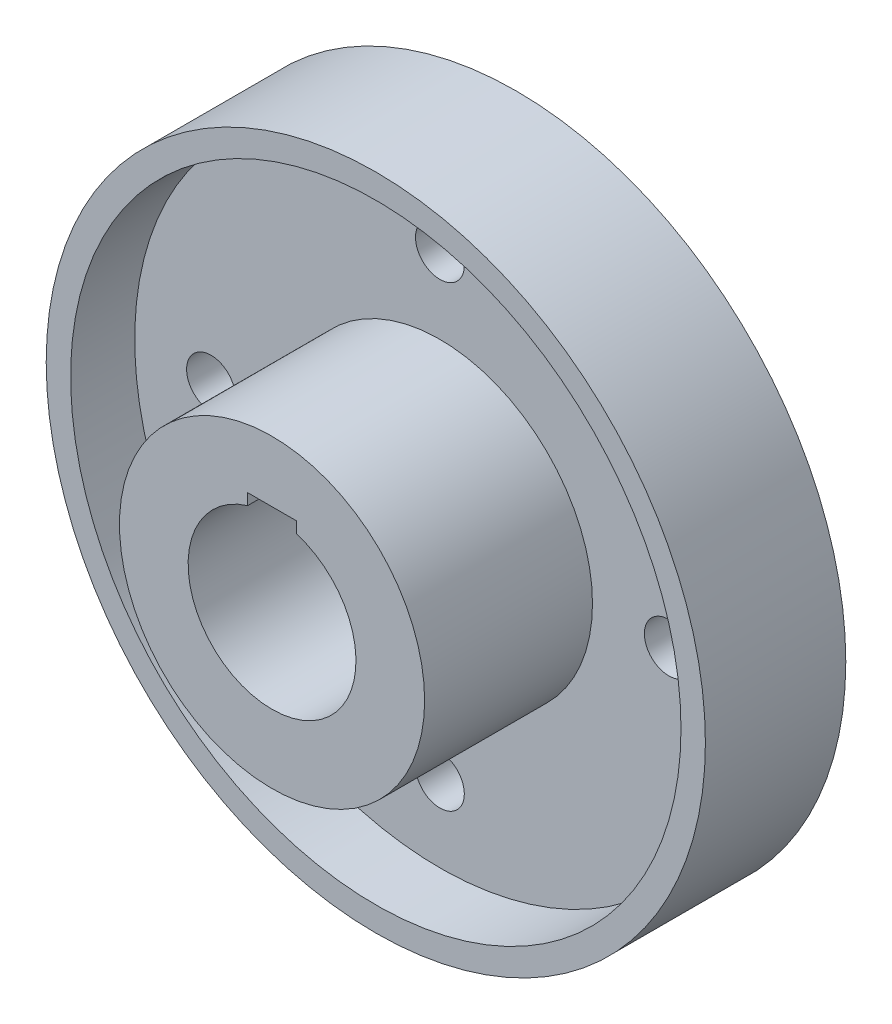
ISO-10303-21;
HEADER;
FILE_DESCRIPTION(('STEP AP214'),'2;1');
FILE_NAME('part.step','',(''),(''),'','','');
FILE_SCHEMA(('AUTOMOTIVE_DESIGN { 1 0 10303 214 1 1 1 1 }'));
ENDSEC;
DATA;
#1=APPLICATION_CONTEXT('core data for automotive mechanical design processes');
#2=APPLICATION_PROTOCOL_DEFINITION('international standard','automotive_design',2000,#1);
#3=PRODUCT_CONTEXT('',#1,'mechanical');
#4=PRODUCT('Part','Part','',(#3));
#5=PRODUCT_RELATED_PRODUCT_CATEGORY('part','',(#4));
#6=PRODUCT_DEFINITION_FORMATION('','',#4);
#7=PRODUCT_DEFINITION_CONTEXT('part definition',#1,'design');
#8=PRODUCT_DEFINITION('design','',#6,#7);
#9=PRODUCT_DEFINITION_SHAPE('','',#8);
#10=(LENGTH_UNIT() NAMED_UNIT(*) SI_UNIT(.MILLI.,.METRE.));
#11=(NAMED_UNIT(*) PLANE_ANGLE_UNIT() SI_UNIT($,.RADIAN.));
#12=(NAMED_UNIT(*) SI_UNIT($,.STERADIAN.) SOLID_ANGLE_UNIT());
#13=UNCERTAINTY_MEASURE_WITH_UNIT(LENGTH_MEASURE(1.E-05),#10,'distance_accuracy_value','');
#14=(GEOMETRIC_REPRESENTATION_CONTEXT(3) GLOBAL_UNCERTAINTY_ASSIGNED_CONTEXT((#13)) GLOBAL_UNIT_ASSIGNED_CONTEXT((#10,
#11,#12)) REPRESENTATION_CONTEXT('',''));
#15=CARTESIAN_POINT('',(0.,0.,0.));
#16=DIRECTION('',(0.,0.,1.));
#17=DIRECTION('',(1.,0.,0.));
#18=AXIS2_PLACEMENT_3D('',#15,#16,#17);
#19=CARTESIAN_POINT('',(0.,0.,25.));
#20=DIRECTION('',(0.,0.,-1.));
#21=DIRECTION('',(-1.,0.,0.));
#22=AXIS2_PLACEMENT_3D('',#19,#20,#21);
#23=CYLINDRICAL_SURFACE('',#22,108.);
#24=CARTESIAN_POINT('',(0.,0.,0.));
#25=DIRECTION('',(0.,0.,1.));
#26=DIRECTION('',(1.,0.,0.));
#27=AXIS2_PLACEMENT_3D('',#24,#25,#26);
#28=CIRCLE('',#27,108.);
#29=CARTESIAN_POINT('',(108.,0.,0.));
#30=VERTEX_POINT('',#29);
#31=EDGE_CURVE('E149',#30,#30,#28,.T.);
#32=ORIENTED_EDGE('',*,*,#31,.T.);
#33=EDGE_LOOP('',(#32));
#34=FACE_BOUND('',#33,.T.);
#35=CARTESIAN_POINT('',(0.,0.,46.));
#36=DIRECTION('',(0.,0.,1.));
#37=DIRECTION('',(1.,0.,0.));
#38=AXIS2_PLACEMENT_3D('',#35,#36,#37);
#39=CIRCLE('',#38,108.);
#40=CARTESIAN_POINT('',(108.,0.,46.));
#41=VERTEX_POINT('',#40);
#42=EDGE_CURVE('E146',#41,#41,#39,.T.);
#43=ORIENTED_EDGE('',*,*,#42,.F.);
#44=EDGE_LOOP('',(#43));
#45=FACE_BOUND('',#44,.T.);
#46=ADVANCED_FACE('F35',(#34,#45),#23,.T.);
#47=CARTESIAN_POINT('',(0.,0.,0.));
#48=DIRECTION('',(0.,0.,1.));
#49=DIRECTION('',(1.,0.,0.));
#50=AXIS2_PLACEMENT_3D('',#47,#48,#49);
#51=PLANE('',#50);
#52=CARTESIAN_POINT('',(0.,75.,0.));
#53=DIRECTION('',(0.,0.,1.));
#54=DIRECTION('',(1.,0.,0.));
#55=AXIS2_PLACEMENT_3D('',#52,#53,#54);
#56=CIRCLE('',#55,8.);
#57=CARTESIAN_POINT('',(8.,75.,0.));
#58=VERTEX_POINT('',#57);
#59=EDGE_CURVE('E123',#58,#58,#56,.T.);
#60=ORIENTED_EDGE('',*,*,#59,.T.);
#61=EDGE_LOOP('',(#60));
#62=FACE_BOUND('',#61,.T.);
#63=CARTESIAN_POINT('',(75.,0.,0.));
#64=DIRECTION('',(0.,0.,1.));
#65=DIRECTION('',(1.,0.,0.));
#66=AXIS2_PLACEMENT_3D('',#63,#64,#65);
#67=CIRCLE('',#66,8.00000000000026);
#68=CARTESIAN_POINT('',(83.0000000000003,0.,0.));
#69=VERTEX_POINT('',#68);
#70=EDGE_CURVE('E120',#69,#69,#67,.T.);
#71=ORIENTED_EDGE('',*,*,#70,.T.);
#72=EDGE_LOOP('',(#71));
#73=FACE_BOUND('',#72,.T.);
#74=CARTESIAN_POINT('',(0.,-75.,0.));
#75=DIRECTION('',(0.,0.,1.));
#76=DIRECTION('',(1.,0.,0.));
#77=AXIS2_PLACEMENT_3D('',#74,#75,#76);
#78=CIRCLE('',#77,8.00000000000051);
#79=CARTESIAN_POINT('',(8.00000000000052,-75.,0.));
#80=VERTEX_POINT('',#79);
#81=EDGE_CURVE('E117',#80,#80,#78,.T.);
#82=ORIENTED_EDGE('',*,*,#81,.T.);
#83=EDGE_LOOP('',(#82));
#84=FACE_BOUND('',#83,.T.);
#85=CARTESIAN_POINT('',(-75.,0.,0.));
#86=DIRECTION('',(0.,0.,1.));
#87=DIRECTION('',(1.,0.,0.));
#88=AXIS2_PLACEMENT_3D('',#85,#86,#87);
#89=CIRCLE('',#88,8.00000000000076);
#90=CARTESIAN_POINT('',(-66.9999999999993,0.,0.));
#91=VERTEX_POINT('',#90);
#92=EDGE_CURVE('E106',#91,#91,#89,.T.);
#93=ORIENTED_EDGE('',*,*,#92,.T.);
#94=EDGE_LOOP('',(#93));
#95=FACE_BOUND('',#94,.T.);
#96=CARTESIAN_POINT('',(0.,0.,0.));
#97=DIRECTION('',(0.,0.,-1.));
#98=DIRECTION('',(-1.,0.,0.));
#99=AXIS2_PLACEMENT_3D('',#96,#97,#98);
#100=CIRCLE('',#99,37.5);
#101=CARTESIAN_POINT('',(-37.5,0.,0.));
#102=VERTEX_POINT('',#101);
#103=EDGE_CURVE('E42',#102,#102,#100,.T.);
#104=ORIENTED_EDGE('',*,*,#103,.F.);
#105=EDGE_LOOP('',(#104));
#106=FACE_BOUND('',#105,.T.);
#107=ORIENTED_EDGE('',*,*,#31,.F.);
#108=EDGE_LOOP('',(#107));
#109=FACE_BOUND('',#108,.T.);
#110=ADVANCED_FACE('F175',(#62,#73,#84,#95,#106,#109),#51,.F.);
#111=CARTESIAN_POINT('',(0.,0.,46.));
#112=DIRECTION('',(0.,0.,1.));
#113=DIRECTION('',(1.,0.,0.));
#114=AXIS2_PLACEMENT_3D('',#111,#112,#113);
#115=PLANE('',#114);
#116=ORIENTED_EDGE('',*,*,#42,.T.);
#117=EDGE_LOOP('',(#116));
#118=FACE_BOUND('',#117,.T.);
#119=CARTESIAN_POINT('',(0.,0.,46.));
#120=DIRECTION('',(0.,0.,1.));
#121=DIRECTION('',(1.,0.,0.));
#122=AXIS2_PLACEMENT_3D('',#119,#120,#121);
#123=CIRCLE('',#122,100.);
#124=CARTESIAN_POINT('',(100.,0.,46.));
#125=VERTEX_POINT('',#124);
#126=EDGE_CURVE('E141',#125,#125,#123,.T.);
#127=ORIENTED_EDGE('',*,*,#126,.F.);
#128=EDGE_LOOP('',(#127));
#129=FACE_BOUND('',#128,.T.);
#130=ADVANCED_FACE('F168',(#118,#129),#115,.T.);
#131=CARTESIAN_POINT('',(0.,0.,46.));
#132=DIRECTION('',(0.,0.,-1.));
#133=DIRECTION('',(-1.,0.,0.));
#134=AXIS2_PLACEMENT_3D('',#131,#132,#133);
#135=CYLINDRICAL_SURFACE('',#134,100.);
#136=ORIENTED_EDGE('',*,*,#126,.T.);
#137=EDGE_LOOP('',(#136));
#138=FACE_BOUND('',#137,.T.);
#139=CARTESIAN_POINT('',(0.,0.,25.));
#140=DIRECTION('',(0.,0.,1.));
#141=DIRECTION('',(1.,0.,0.));
#142=AXIS2_PLACEMENT_3D('',#139,#140,#141);
#143=CIRCLE('',#142,100.);
#144=CARTESIAN_POINT('',(100.,0.,25.));
#145=VERTEX_POINT('',#144);
#146=EDGE_CURVE('E134',#145,#145,#143,.F.);
#147=ORIENTED_EDGE('',*,*,#146,.T.);
#148=EDGE_LOOP('',(#147));
#149=FACE_BOUND('',#148,.T.);
#150=ADVANCED_FACE('F154',(#138,#149),#135,.F.);
#151=CARTESIAN_POINT('',(0.,0.,25.));
#152=DIRECTION('',(0.,0.,1.));
#153=DIRECTION('',(1.,0.,0.));
#154=AXIS2_PLACEMENT_3D('',#151,#152,#153);
#155=PLANE('',#154);
#156=CARTESIAN_POINT('',(0.,75.,25.));
#157=DIRECTION('',(0.,0.,1.));
#158=DIRECTION('',(1.,0.,0.));
#159=AXIS2_PLACEMENT_3D('',#156,#157,#158);
#160=CIRCLE('',#159,8.);
#161=CARTESIAN_POINT('',(8.,75.,25.));
#162=VERTEX_POINT('',#161);
#163=EDGE_CURVE('E103',#162,#162,#160,.T.);
#164=ORIENTED_EDGE('',*,*,#163,.F.);
#165=EDGE_LOOP('',(#164));
#166=FACE_BOUND('',#165,.T.);
#167=CARTESIAN_POINT('',(75.,0.,25.));
#168=DIRECTION('',(0.,0.,1.));
#169=DIRECTION('',(1.,0.,0.));
#170=AXIS2_PLACEMENT_3D('',#167,#168,#169);
#171=CIRCLE('',#170,8.00000000000026);
#172=CARTESIAN_POINT('',(83.0000000000003,0.,25.));
#173=VERTEX_POINT('',#172);
#174=EDGE_CURVE('E107',#173,#173,#171,.T.);
#175=ORIENTED_EDGE('',*,*,#174,.F.);
#176=EDGE_LOOP('',(#175));
#177=FACE_BOUND('',#176,.T.);
#178=CARTESIAN_POINT('',(0.,-75.,25.));
#179=DIRECTION('',(0.,0.,1.));
#180=DIRECTION('',(1.,0.,0.));
#181=AXIS2_PLACEMENT_3D('',#178,#179,#180);
#182=CIRCLE('',#181,8.00000000000051);
#183=CARTESIAN_POINT('',(8.00000000000052,-75.,25.));
#184=VERTEX_POINT('',#183);
#185=EDGE_CURVE('E110',#184,#184,#182,.T.);
#186=ORIENTED_EDGE('',*,*,#185,.F.);
#187=EDGE_LOOP('',(#186));
#188=FACE_BOUND('',#187,.T.);
#189=CARTESIAN_POINT('',(-75.,0.,25.));
#190=DIRECTION('',(0.,0.,1.));
#191=DIRECTION('',(1.,0.,0.));
#192=AXIS2_PLACEMENT_3D('',#189,#190,#191);
#193=CIRCLE('',#192,8.00000000000076);
#194=CARTESIAN_POINT('',(-66.9999999999993,0.,25.));
#195=VERTEX_POINT('',#194);
#196=EDGE_CURVE('E102',#195,#195,#193,.T.);
#197=ORIENTED_EDGE('',*,*,#196,.F.);
#198=EDGE_LOOP('',(#197));
#199=FACE_BOUND('',#198,.T.);
#200=CARTESIAN_POINT('',(0.,0.,25.));
#201=DIRECTION('',(0.,0.,1.));
#202=DIRECTION('',(1.,0.,0.));
#203=AXIS2_PLACEMENT_3D('',#200,#201,#202);
#204=CIRCLE('',#203,50.);
#205=CARTESIAN_POINT('',(50.,0.,25.));
#206=VERTEX_POINT('',#205);
#207=EDGE_CURVE('E137',#206,#206,#204,.T.);
#208=ORIENTED_EDGE('',*,*,#207,.F.);
#209=EDGE_LOOP('',(#208));
#210=FACE_BOUND('',#209,.T.);
#211=ORIENTED_EDGE('',*,*,#146,.F.);
#212=EDGE_LOOP('',(#211));
#213=FACE_BOUND('',#212,.T.);
#214=ADVANCED_FACE('F156',(#166,#177,#188,#199,#210,#213),#155,.T.);
#215=CARTESIAN_POINT('',(0.,0.,80.));
#216=DIRECTION('',(0.,0.,1.));
#217=DIRECTION('',(1.,0.,0.));
#218=AXIS2_PLACEMENT_3D('',#215,#216,#217);
#219=PLANE('',#218);
#220=DIRECTION('',(0.,-1.,0.));
#221=VECTOR('',#220,1.);
#222=CARTESIAN_POINT('',(-8.,30.,80.));
#223=LINE('',#222,#221);
#224=CARTESIAN_POINT('',(-8.,30.,80.));
#225=VERTEX_POINT('',#224);
#226=CARTESIAN_POINT('',(-8.,26.3106442338457,80.));
#227=VERTEX_POINT('',#226);
#228=EDGE_CURVE('E95',#225,#227,#223,.T.);
#229=ORIENTED_EDGE('',*,*,#228,.F.);
#230=DIRECTION('',(1.,0.,0.));
#231=VECTOR('',#230,1.);
#232=CARTESIAN_POINT('',(-8.,30.,80.));
#233=LINE('',#232,#231);
#234=CARTESIAN_POINT('',(8.,30.,80.));
#235=VERTEX_POINT('',#234);
#236=EDGE_CURVE('E80',#225,#235,#233,.T.);
#237=ORIENTED_EDGE('',*,*,#236,.T.);
#238=DIRECTION('',(0.,1.,0.));
#239=VECTOR('',#238,1.);
#240=CARTESIAN_POINT('',(8.,0.,80.));
#241=LINE('',#240,#239);
#242=CARTESIAN_POINT('',(8.,26.3106442338457,80.));
#243=VERTEX_POINT('',#242);
#244=EDGE_CURVE('E97',#243,#235,#241,.T.);
#245=ORIENTED_EDGE('',*,*,#244,.F.);
#246=CARTESIAN_POINT('',(0.,0.,80.));
#247=DIRECTION('',(0.,0.,1.));
#248=DIRECTION('',(1.,0.,0.));
#249=AXIS2_PLACEMENT_3D('',#246,#247,#248);
#250=CIRCLE('',#249,27.5);
#251=EDGE_CURVE('E131',#227,#243,#250,.T.);
#252=ORIENTED_EDGE('',*,*,#251,.F.);
#253=EDGE_LOOP('',(#229,#237,#245,#252));
#254=FACE_BOUND('',#253,.T.);
#255=CARTESIAN_POINT('',(0.,0.,80.));
#256=DIRECTION('',(0.,0.,1.));
#257=DIRECTION('',(1.,0.,0.));
#258=AXIS2_PLACEMENT_3D('',#255,#256,#257);
#259=CIRCLE('',#258,50.);
#260=CARTESIAN_POINT('',(50.,0.,80.));
#261=VERTEX_POINT('',#260);
#262=EDGE_CURVE('E138',#261,#261,#259,.T.);
#263=ORIENTED_EDGE('',*,*,#262,.T.);
#264=EDGE_LOOP('',(#263));
#265=FACE_BOUND('',#264,.T.);
#266=ADVANCED_FACE('F158',(#254,#265),#219,.T.);
#267=CARTESIAN_POINT('',(0.,0.,80.));
#268=DIRECTION('',(0.,0.,-1.));
#269=DIRECTION('',(-1.,0.,0.));
#270=AXIS2_PLACEMENT_3D('',#267,#268,#269);
#271=CYLINDRICAL_SURFACE('',#270,50.);
#272=ORIENTED_EDGE('',*,*,#262,.F.);
#273=EDGE_LOOP('',(#272));
#274=FACE_BOUND('',#273,.T.);
#275=ORIENTED_EDGE('',*,*,#207,.T.);
#276=EDGE_LOOP('',(#275));
#277=FACE_BOUND('',#276,.T.);
#278=ADVANCED_FACE('F165',(#274,#277),#271,.T.);
#279=CARTESIAN_POINT('',(0.,0.,80.));
#280=DIRECTION('',(0.,0.,-1.));
#281=DIRECTION('',(-1.,0.,0.));
#282=AXIS2_PLACEMENT_3D('',#279,#280,#281);
#283=CYLINDRICAL_SURFACE('',#282,27.5);
#284=DIRECTION('',(0.,0.,-1.));
#285=VECTOR('',#284,1.);
#286=CARTESIAN_POINT('',(-8.,26.3106442338457,80.));
#287=LINE('',#286,#285);
#288=CARTESIAN_POINT('',(-8.,26.3106442338457,-5.));
#289=VERTEX_POINT('',#288);
#290=EDGE_CURVE('E56',#227,#289,#287,.T.);
#291=ORIENTED_EDGE('',*,*,#290,.F.);
#292=ORIENTED_EDGE('',*,*,#251,.T.);
#293=DIRECTION('',(0.,0.,-1.));
#294=VECTOR('',#293,1.);
#295=CARTESIAN_POINT('',(8.,26.3106442338457,80.));
#296=LINE('',#295,#294);
#297=CARTESIAN_POINT('',(8.,26.3106442338457,-5.));
#298=VERTEX_POINT('',#297);
#299=EDGE_CURVE('E82',#298,#243,#296,.F.);
#300=ORIENTED_EDGE('',*,*,#299,.F.);
#301=CARTESIAN_POINT('',(0.,0.,-5.));
#302=DIRECTION('',(0.,0.,1.));
#303=DIRECTION('',(1.,0.,0.));
#304=AXIS2_PLACEMENT_3D('',#301,#302,#303);
#305=CIRCLE('',#304,27.5);
#306=EDGE_CURVE('E126',#289,#298,#305,.T.);
#307=ORIENTED_EDGE('',*,*,#306,.F.);
#308=EDGE_LOOP('',(#291,#292,#300,#307));
#309=FACE_BOUND('',#308,.T.);
#310=ADVANCED_FACE('F192',(#309),#283,.F.);
#311=CARTESIAN_POINT('',(0.,0.,-5.));
#312=DIRECTION('',(0.,0.,1.));
#313=DIRECTION('',(1.,0.,0.));
#314=AXIS2_PLACEMENT_3D('',#311,#312,#313);
#315=CYLINDRICAL_SURFACE('',#314,37.5);
#316=CARTESIAN_POINT('',(0.,0.,-5.));
#317=DIRECTION('',(0.,0.,-1.));
#318=DIRECTION('',(-1.,0.,0.));
#319=AXIS2_PLACEMENT_3D('',#316,#317,#318);
#320=CIRCLE('',#319,37.5);
#321=CARTESIAN_POINT('',(-37.5,0.,-5.));
#322=VERTEX_POINT('',#321);
#323=EDGE_CURVE('E128',#322,#322,#320,.T.);
#324=ORIENTED_EDGE('',*,*,#323,.F.);
#325=EDGE_LOOP('',(#324));
#326=FACE_BOUND('',#325,.T.);
#327=ORIENTED_EDGE('',*,*,#103,.T.);
#328=EDGE_LOOP('',(#327));
#329=FACE_BOUND('',#328,.T.);
#330=ADVANCED_FACE('F197',(#326,#329),#315,.T.);
#331=CARTESIAN_POINT('',(0.,0.,-5.));
#332=DIRECTION('',(0.,0.,-1.));
#333=DIRECTION('',(-1.,0.,0.));
#334=AXIS2_PLACEMENT_3D('',#331,#332,#333);
#335=PLANE('',#334);
#336=DIRECTION('',(0.,-1.,0.));
#337=VECTOR('',#336,1.);
#338=CARTESIAN_POINT('',(-8.,30.,-5.));
#339=LINE('',#338,#337);
#340=CARTESIAN_POINT('',(-8.,30.,-5.));
#341=VERTEX_POINT('',#340);
#342=EDGE_CURVE('E84',#341,#289,#339,.T.);
#343=ORIENTED_EDGE('',*,*,#342,.T.);
#344=ORIENTED_EDGE('',*,*,#306,.T.);
#345=DIRECTION('',(0.,-1.,0.));
#346=VECTOR('',#345,1.);
#347=CARTESIAN_POINT('',(8.,0.,-5.));
#348=LINE('',#347,#346);
#349=CARTESIAN_POINT('',(8.,30.,-5.));
#350=VERTEX_POINT('',#349);
#351=EDGE_CURVE('E11',#350,#298,#348,.T.);
#352=ORIENTED_EDGE('',*,*,#351,.F.);
#353=DIRECTION('',(1.,0.,0.));
#354=VECTOR('',#353,1.);
#355=CARTESIAN_POINT('',(-8.,30.,-5.));
#356=LINE('',#355,#354);
#357=EDGE_CURVE('E77',#341,#350,#356,.T.);
#358=ORIENTED_EDGE('',*,*,#357,.F.);
#359=EDGE_LOOP('',(#343,#344,#352,#358));
#360=FACE_BOUND('',#359,.T.);
#361=ORIENTED_EDGE('',*,*,#323,.T.);
#362=EDGE_LOOP('',(#361));
#363=FACE_BOUND('',#362,.T.);
#364=ADVANCED_FACE('F90',(#360,#363),#335,.T.);
#365=CARTESIAN_POINT('',(-75.,0.,-5.));
#366=DIRECTION('',(0.,0.,1.));
#367=DIRECTION('',(1.,0.,0.));
#368=AXIS2_PLACEMENT_3D('',#365,#366,#367);
#369=CYLINDRICAL_SURFACE('',#368,8.00000000000076);
#370=ORIENTED_EDGE('',*,*,#196,.T.);
#371=EDGE_LOOP('',(#370));
#372=FACE_BOUND('',#371,.T.);
#373=ORIENTED_EDGE('',*,*,#92,.F.);
#374=EDGE_LOOP('',(#373));
#375=FACE_BOUND('',#374,.T.);
#376=ADVANCED_FACE('F204',(#372,#375),#369,.F.);
#377=CARTESIAN_POINT('',(0.,-75.,-5.));
#378=DIRECTION('',(0.,0.,1.));
#379=DIRECTION('',(1.,0.,0.));
#380=AXIS2_PLACEMENT_3D('',#377,#378,#379);
#381=CYLINDRICAL_SURFACE('',#380,8.00000000000051);
#382=ORIENTED_EDGE('',*,*,#185,.T.);
#383=EDGE_LOOP('',(#382));
#384=FACE_BOUND('',#383,.T.);
#385=ORIENTED_EDGE('',*,*,#81,.F.);
#386=EDGE_LOOP('',(#385));
#387=FACE_BOUND('',#386,.T.);
#388=ADVANCED_FACE('F207',(#384,#387),#381,.F.);
#389=CARTESIAN_POINT('',(75.,0.,-5.));
#390=DIRECTION('',(0.,0.,1.));
#391=DIRECTION('',(1.,0.,0.));
#392=AXIS2_PLACEMENT_3D('',#389,#390,#391);
#393=CYLINDRICAL_SURFACE('',#392,8.00000000000026);
#394=ORIENTED_EDGE('',*,*,#174,.T.);
#395=EDGE_LOOP('',(#394));
#396=FACE_BOUND('',#395,.T.);
#397=ORIENTED_EDGE('',*,*,#70,.F.);
#398=EDGE_LOOP('',(#397));
#399=FACE_BOUND('',#398,.T.);
#400=ADVANCED_FACE('F211',(#396,#399),#393,.F.);
#401=CARTESIAN_POINT('',(0.,75.,-5.));
#402=DIRECTION('',(0.,0.,1.));
#403=DIRECTION('',(1.,0.,0.));
#404=AXIS2_PLACEMENT_3D('',#401,#402,#403);
#405=CYLINDRICAL_SURFACE('',#404,8.);
#406=ORIENTED_EDGE('',*,*,#163,.T.);
#407=EDGE_LOOP('',(#406));
#408=FACE_BOUND('',#407,.T.);
#409=ORIENTED_EDGE('',*,*,#59,.F.);
#410=EDGE_LOOP('',(#409));
#411=FACE_BOUND('',#410,.T.);
#412=ADVANCED_FACE('F215',(#408,#411),#405,.F.);
#413=CARTESIAN_POINT('',(-8.,30.,-5.));
#414=DIRECTION('',(-1.,0.,0.));
#415=DIRECTION('',(0.,0.,1.));
#416=AXIS2_PLACEMENT_3D('',#413,#414,#415);
#417=PLANE('',#416);
#418=ORIENTED_EDGE('',*,*,#290,.T.);
#419=ORIENTED_EDGE('',*,*,#342,.F.);
#420=DIRECTION('',(0.,0.,1.));
#421=VECTOR('',#420,1.);
#422=CARTESIAN_POINT('',(-8.,30.,-5.));
#423=LINE('',#422,#421);
#424=EDGE_CURVE('E74',#341,#225,#423,.T.);
#425=ORIENTED_EDGE('',*,*,#424,.T.);
#426=ORIENTED_EDGE('',*,*,#228,.T.);
#427=EDGE_LOOP('',(#418,#419,#425,#426));
#428=FACE_BOUND('',#427,.T.);
#429=ADVANCED_FACE('F85',(#428),#417,.F.);
#430=CARTESIAN_POINT('',(-8.,30.,-5.));
#431=DIRECTION('',(0.,-1.,0.));
#432=DIRECTION('',(1.,0.,0.));
#433=AXIS2_PLACEMENT_3D('',#430,#431,#432);
#434=PLANE('',#433);
#435=ORIENTED_EDGE('',*,*,#236,.F.);
#436=ORIENTED_EDGE('',*,*,#424,.F.);
#437=ORIENTED_EDGE('',*,*,#357,.T.);
#438=DIRECTION('',(0.,0.,1.));
#439=VECTOR('',#438,1.);
#440=CARTESIAN_POINT('',(8.,30.,-5.));
#441=LINE('',#440,#439);
#442=EDGE_CURVE('E48',#350,#235,#441,.T.);
#443=ORIENTED_EDGE('',*,*,#442,.T.);
#444=EDGE_LOOP('',(#435,#436,#437,#443));
#445=FACE_BOUND('',#444,.T.);
#446=ADVANCED_FACE('F75',(#445),#434,.T.);
#447=CARTESIAN_POINT('',(8.,0.,-5.));
#448=DIRECTION('',(1.,0.,0.));
#449=DIRECTION('',(0.,0.,-1.));
#450=AXIS2_PLACEMENT_3D('',#447,#448,#449);
#451=PLANE('',#450);
#452=ORIENTED_EDGE('',*,*,#299,.T.);
#453=ORIENTED_EDGE('',*,*,#244,.T.);
#454=ORIENTED_EDGE('',*,*,#442,.F.);
#455=ORIENTED_EDGE('',*,*,#351,.T.);
#456=EDGE_LOOP('',(#452,#453,#454,#455));
#457=FACE_BOUND('',#456,.T.);
#458=ADVANCED_FACE('F222',(#457),#451,.F.);
#459=CLOSED_SHELL('',(#46,#110,#130,#150,#214,#266,#278,#310,#330,#364,#376,#388,#400,#412,#429,
#446,#458));
#460=MANIFOLD_SOLID_BREP('B2',#459);
#461=ADVANCED_BREP_SHAPE_REPRESENTATION('',(#18,#460),#14);
#462=SHAPE_DEFINITION_REPRESENTATION(#9,#461);
ENDSEC;
END-ISO-10303-21;
